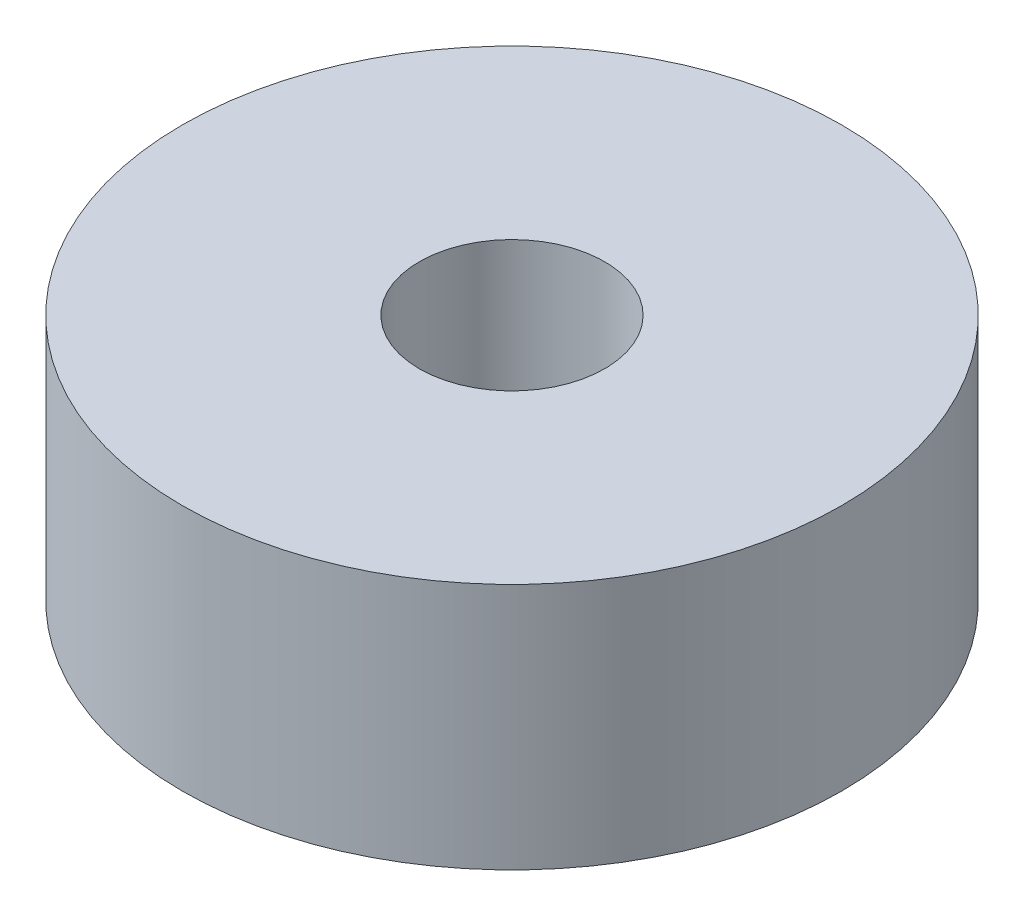
ISO-10303-21;
HEADER;
FILE_DESCRIPTION(('STEP AP214'),'2;1');
FILE_NAME('part.step','',(''),(''),'','','');
FILE_SCHEMA(('AUTOMOTIVE_DESIGN { 1 0 10303 214 1 1 1 1 }'));
ENDSEC;
DATA;
#1=APPLICATION_CONTEXT('core data for automotive mechanical design processes');
#2=APPLICATION_PROTOCOL_DEFINITION('international standard','automotive_design',2000,#1);
#3=PRODUCT_CONTEXT('',#1,'mechanical');
#4=PRODUCT('Part','Part','',(#3));
#5=PRODUCT_RELATED_PRODUCT_CATEGORY('part','',(#4));
#6=PRODUCT_DEFINITION_FORMATION('','',#4);
#7=PRODUCT_DEFINITION_CONTEXT('part definition',#1,'design');
#8=PRODUCT_DEFINITION('design','',#6,#7);
#9=PRODUCT_DEFINITION_SHAPE('','',#8);
#10=(LENGTH_UNIT() NAMED_UNIT(*) SI_UNIT(.MILLI.,.METRE.));
#11=(NAMED_UNIT(*) PLANE_ANGLE_UNIT() SI_UNIT($,.RADIAN.));
#12=(NAMED_UNIT(*) SI_UNIT($,.STERADIAN.) SOLID_ANGLE_UNIT());
#13=UNCERTAINTY_MEASURE_WITH_UNIT(LENGTH_MEASURE(1.E-05),#10,'distance_accuracy_value','');
#14=(GEOMETRIC_REPRESENTATION_CONTEXT(3) GLOBAL_UNCERTAINTY_ASSIGNED_CONTEXT((#13)) GLOBAL_UNIT_ASSIGNED_CONTEXT((#10,
#11,#12)) REPRESENTATION_CONTEXT('',''));
#15=CARTESIAN_POINT('',(0.,0.,0.));
#16=DIRECTION('',(0.,0.,1.));
#17=DIRECTION('',(1.,0.,0.));
#18=AXIS2_PLACEMENT_3D('',#15,#16,#17);
#19=CARTESIAN_POINT('',(0.,6.,0.));
#20=DIRECTION('',(0.,1.,0.));
#21=DIRECTION('',(0.,0.,1.));
#22=AXIS2_PLACEMENT_3D('',#19,#20,#21);
#23=PLANE('',#22);
#24=CARTESIAN_POINT('',(0.,6.,0.));
#25=DIRECTION('',(0.,1.,0.));
#26=DIRECTION('',(0.,0.,1.));
#27=AXIS2_PLACEMENT_3D('',#24,#25,#26);
#28=CIRCLE('',#27,8.);
#29=CARTESIAN_POINT('',(0.,6.,8.));
#30=VERTEX_POINT('',#29);
#31=EDGE_CURVE('E10',#30,#30,#28,.T.);
#32=ORIENTED_EDGE('',*,*,#31,.T.);
#33=EDGE_LOOP('',(#32));
#34=FACE_BOUND('',#33,.T.);
#35=CARTESIAN_POINT('',(0.,6.,0.));
#36=DIRECTION('',(0.,1.,0.));
#37=DIRECTION('',(0.,0.,1.));
#38=AXIS2_PLACEMENT_3D('',#35,#36,#37);
#39=CIRCLE('',#38,2.25);
#40=CARTESIAN_POINT('',(0.,6.,2.25));
#41=VERTEX_POINT('',#40);
#42=EDGE_CURVE('E44',#41,#41,#39,.T.);
#43=ORIENTED_EDGE('',*,*,#42,.F.);
#44=EDGE_LOOP('',(#43));
#45=FACE_BOUND('',#44,.T.);
#46=ADVANCED_FACE('F33',(#34,#45),#23,.T.);
#47=CARTESIAN_POINT('',(0.,0.,0.));
#48=DIRECTION('',(0.,1.,0.));
#49=DIRECTION('',(0.,0.,1.));
#50=AXIS2_PLACEMENT_3D('',#47,#48,#49);
#51=PLANE('',#50);
#52=CARTESIAN_POINT('',(0.,0.,0.));
#53=DIRECTION('',(0.,1.,0.));
#54=DIRECTION('',(0.,0.,1.));
#55=AXIS2_PLACEMENT_3D('',#52,#53,#54);
#56=CIRCLE('',#55,8.);
#57=CARTESIAN_POINT('',(0.,0.,8.));
#58=VERTEX_POINT('',#57);
#59=EDGE_CURVE('E37',#58,#58,#56,.T.);
#60=ORIENTED_EDGE('',*,*,#59,.F.);
#61=EDGE_LOOP('',(#60));
#62=FACE_BOUND('',#61,.T.);
#63=CARTESIAN_POINT('',(0.,0.,0.));
#64=DIRECTION('',(0.,1.,0.));
#65=DIRECTION('',(0.,0.,1.));
#66=AXIS2_PLACEMENT_3D('',#63,#64,#65);
#67=CIRCLE('',#66,2.25);
#68=CARTESIAN_POINT('',(0.,0.,2.25));
#69=VERTEX_POINT('',#68);
#70=EDGE_CURVE('E46',#69,#69,#67,.T.);
#71=ORIENTED_EDGE('',*,*,#70,.T.);
#72=EDGE_LOOP('',(#71));
#73=FACE_BOUND('',#72,.T.);
#74=ADVANCED_FACE('F56',(#62,#73),#51,.F.);
#75=CARTESIAN_POINT('',(0.,6.,0.));
#76=DIRECTION('',(0.,-1.,0.));
#77=DIRECTION('',(0.,0.,-1.));
#78=AXIS2_PLACEMENT_3D('',#75,#76,#77);
#79=CYLINDRICAL_SURFACE('',#78,8.);
#80=ORIENTED_EDGE('',*,*,#31,.F.);
#81=EDGE_LOOP('',(#80));
#82=FACE_BOUND('',#81,.T.);
#83=ORIENTED_EDGE('',*,*,#59,.T.);
#84=EDGE_LOOP('',(#83));
#85=FACE_BOUND('',#84,.T.);
#86=ADVANCED_FACE('F35',(#82,#85),#79,.T.);
#87=CARTESIAN_POINT('',(0.,6.,0.));
#88=DIRECTION('',(0.,-1.,0.));
#89=DIRECTION('',(0.,0.,-1.));
#90=AXIS2_PLACEMENT_3D('',#87,#88,#89);
#91=CYLINDRICAL_SURFACE('',#90,2.25);
#92=ORIENTED_EDGE('',*,*,#42,.T.);
#93=EDGE_LOOP('',(#92));
#94=FACE_BOUND('',#93,.T.);
#95=ORIENTED_EDGE('',*,*,#70,.F.);
#96=EDGE_LOOP('',(#95));
#97=FACE_BOUND('',#96,.T.);
#98=ADVANCED_FACE('F52',(#94,#97),#91,.F.);
#99=CLOSED_SHELL('',(#46,#74,#86,#98));
#100=MANIFOLD_SOLID_BREP('B2',#99);
#101=ADVANCED_BREP_SHAPE_REPRESENTATION('',(#18,#100),#14);
#102=SHAPE_DEFINITION_REPRESENTATION(#9,#101);
ENDSEC;
END-ISO-10303-21;
